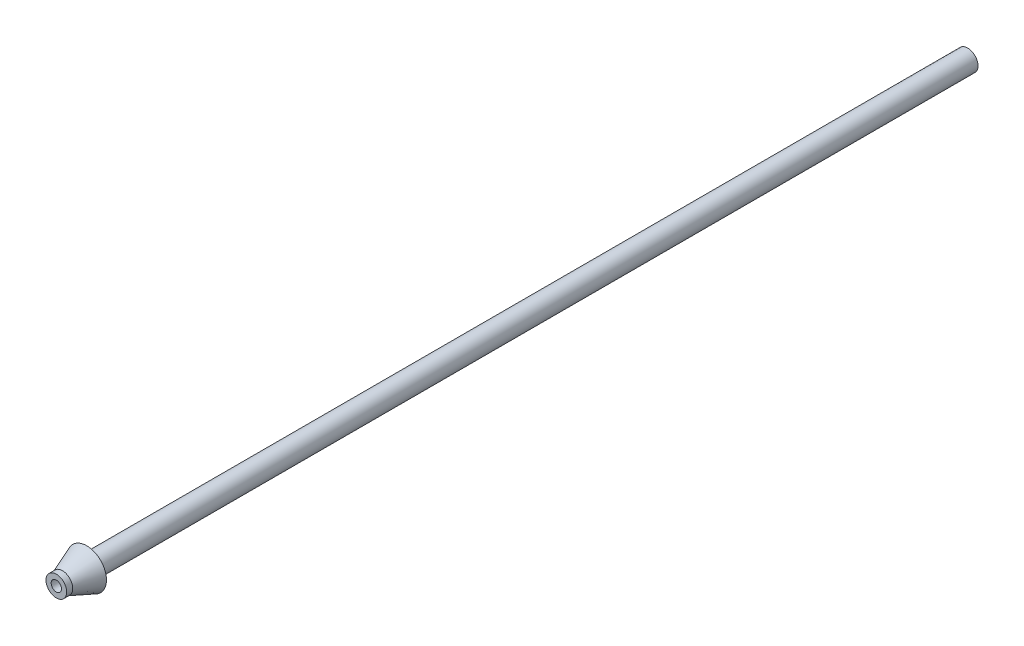
ISO-10303-21;
HEADER;
FILE_DESCRIPTION(('STEP AP214'),'2;1');
FILE_NAME('part.step','',(''),(''),'','','');
FILE_SCHEMA(('AUTOMOTIVE_DESIGN { 1 0 10303 214 1 1 1 1 }'));
ENDSEC;
DATA;
#1=APPLICATION_CONTEXT('core data for automotive mechanical design processes');
#2=APPLICATION_PROTOCOL_DEFINITION('international standard','automotive_design',2000,#1);
#3=PRODUCT_CONTEXT('',#1,'mechanical');
#4=PRODUCT('Part','Part','',(#3));
#5=PRODUCT_RELATED_PRODUCT_CATEGORY('part','',(#4));
#6=PRODUCT_DEFINITION_FORMATION('','',#4);
#7=PRODUCT_DEFINITION_CONTEXT('part definition',#1,'design');
#8=PRODUCT_DEFINITION('design','',#6,#7);
#9=PRODUCT_DEFINITION_SHAPE('','',#8);
#10=(LENGTH_UNIT() NAMED_UNIT(*) SI_UNIT(.MILLI.,.METRE.));
#11=(NAMED_UNIT(*) PLANE_ANGLE_UNIT() SI_UNIT($,.RADIAN.));
#12=(NAMED_UNIT(*) SI_UNIT($,.STERADIAN.) SOLID_ANGLE_UNIT());
#13=UNCERTAINTY_MEASURE_WITH_UNIT(LENGTH_MEASURE(1.E-05),#10,'distance_accuracy_value','');
#14=(GEOMETRIC_REPRESENTATION_CONTEXT(3) GLOBAL_UNCERTAINTY_ASSIGNED_CONTEXT((#13)) GLOBAL_UNIT_ASSIGNED_CONTEXT((#10,
#11,#12)) REPRESENTATION_CONTEXT('',''));
#15=CARTESIAN_POINT('',(0.,0.,0.));
#16=DIRECTION('',(0.,0.,1.));
#17=DIRECTION('',(1.,0.,0.));
#18=AXIS2_PLACEMENT_3D('',#15,#16,#17);
#19=CARTESIAN_POINT('',(0.,0.,150.));
#20=DIRECTION('',(0.,0.,-1.));
#21=DIRECTION('',(-1.,0.,0.));
#22=AXIS2_PLACEMENT_3D('',#19,#20,#21);
#23=CYLINDRICAL_SURFACE('',#22,1.7);
#24=CARTESIAN_POINT('',(0.,0.,150.));
#25=DIRECTION('',(0.,0.,1.));
#26=DIRECTION('',(1.,0.,0.));
#27=AXIS2_PLACEMENT_3D('',#24,#25,#26);
#28=CIRCLE('',#27,1.7);
#29=CARTESIAN_POINT('',(1.7,0.,150.));
#30=VERTEX_POINT('',#29);
#31=EDGE_CURVE('E41',#30,#30,#28,.T.);
#32=ORIENTED_EDGE('',*,*,#31,.F.);
#33=EDGE_LOOP('',(#32));
#34=FACE_BOUND('',#33,.T.);
#35=CARTESIAN_POINT('',(0.,0.,149.));
#36=DIRECTION('',(0.,0.,-1.));
#37=DIRECTION('',(-1.,0.,0.));
#38=AXIS2_PLACEMENT_3D('',#35,#36,#37);
#39=CIRCLE('',#38,1.7);
#40=CARTESIAN_POINT('',(-1.7,0.,149.));
#41=VERTEX_POINT('',#40);
#42=EDGE_CURVE('E10',#41,#41,#39,.T.);
#43=ORIENTED_EDGE('',*,*,#42,.F.);
#44=EDGE_LOOP('',(#43));
#45=FACE_BOUND('',#44,.T.);
#46=ADVANCED_FACE('F31',(#34,#45),#23,.T.);
#47=CARTESIAN_POINT('',(0.,0.,0.));
#48=DIRECTION('',(0.,0.,1.));
#49=DIRECTION('',(1.,0.,0.));
#50=AXIS2_PLACEMENT_3D('',#47,#48,#49);
#51=CIRCLE('',#50,1.7);
#52=CARTESIAN_POINT('',(1.7,0.,0.));
#53=VERTEX_POINT('',#52);
#54=EDGE_CURVE('E45',#53,#53,#51,.T.);
#55=ORIENTED_EDGE('',*,*,#54,.T.);
#56=EDGE_LOOP('',(#55));
#57=FACE_BOUND('',#56,.T.);
#58=CARTESIAN_POINT('',(0.,0.,145.));
#59=DIRECTION('',(0.,0.,1.));
#60=DIRECTION('',(1.,0.,0.));
#61=AXIS2_PLACEMENT_3D('',#58,#59,#60);
#62=CIRCLE('',#61,1.7);
#63=CARTESIAN_POINT('',(1.7,0.,145.));
#64=VERTEX_POINT('',#63);
#65=EDGE_CURVE('E37',#64,#64,#62,.T.);
#66=ORIENTED_EDGE('',*,*,#65,.F.);
#67=EDGE_LOOP('',(#66));
#68=FACE_BOUND('',#67,.T.);
#69=ADVANCED_FACE('F71',(#57,#68),#23,.T.);
#70=CARTESIAN_POINT('',(0.,0.,150.));
#71=DIRECTION('',(0.,0.,1.));
#72=DIRECTION('',(1.,0.,0.));
#73=AXIS2_PLACEMENT_3D('',#70,#71,#72);
#74=PLANE('',#73);
#75=ORIENTED_EDGE('',*,*,#31,.T.);
#76=EDGE_LOOP('',(#75));
#77=FACE_BOUND('',#76,.T.);
#78=CARTESIAN_POINT('',(0.,0.,150.));
#79=DIRECTION('',(0.,0.,1.));
#80=DIRECTION('',(1.,0.,0.));
#81=AXIS2_PLACEMENT_3D('',#78,#79,#80);
#82=CIRCLE('',#81,0.85);
#83=CARTESIAN_POINT('',(0.85,0.,150.));
#84=VERTEX_POINT('',#83);
#85=EDGE_CURVE('E49',#84,#84,#82,.T.);
#86=ORIENTED_EDGE('',*,*,#85,.F.);
#87=EDGE_LOOP('',(#86));
#88=FACE_BOUND('',#87,.T.);
#89=ADVANCED_FACE('F76',(#77,#88),#74,.T.);
#90=CARTESIAN_POINT('',(0.,0.,0.));
#91=DIRECTION('',(0.,0.,1.));
#92=DIRECTION('',(1.,0.,0.));
#93=AXIS2_PLACEMENT_3D('',#90,#91,#92);
#94=PLANE('',#93);
#95=ORIENTED_EDGE('',*,*,#54,.F.);
#96=EDGE_LOOP('',(#95));
#97=FACE_BOUND('',#96,.T.);
#98=CARTESIAN_POINT('',(0.,0.,0.));
#99=DIRECTION('',(0.,0.,1.));
#100=DIRECTION('',(1.,0.,0.));
#101=AXIS2_PLACEMENT_3D('',#98,#99,#100);
#102=CIRCLE('',#101,0.85);
#103=CARTESIAN_POINT('',(0.85,0.,0.));
#104=VERTEX_POINT('',#103);
#105=EDGE_CURVE('E51',#104,#104,#102,.T.);
#106=ORIENTED_EDGE('',*,*,#105,.T.);
#107=EDGE_LOOP('',(#106));
#108=FACE_BOUND('',#107,.T.);
#109=ADVANCED_FACE('F83',(#97,#108),#94,.F.);
#110=CARTESIAN_POINT('',(0.,0.,150.));
#111=DIRECTION('',(0.,0.,-1.));
#112=DIRECTION('',(-1.,0.,0.));
#113=AXIS2_PLACEMENT_3D('',#110,#111,#112);
#114=CYLINDRICAL_SURFACE('',#113,0.85);
#115=ORIENTED_EDGE('',*,*,#85,.T.);
#116=EDGE_LOOP('',(#115));
#117=FACE_BOUND('',#116,.T.);
#118=ORIENTED_EDGE('',*,*,#105,.F.);
#119=EDGE_LOOP('',(#118));
#120=FACE_BOUND('',#119,.T.);
#121=ADVANCED_FACE('F68',(#117,#120),#114,.F.);
#122=CARTESIAN_POINT('',(0.,0.,145.));
#123=DIRECTION('',(0.,0.,-1.));
#124=DIRECTION('',(-1.,0.,0.));
#125=AXIS2_PLACEMENT_3D('',#122,#123,#124);
#126=CONICAL_SURFACE('',#125,3.25,0.369684288795301);
#127=ORIENTED_EDGE('',*,*,#42,.T.);
#128=EDGE_LOOP('',(#127));
#129=FACE_BOUND('',#128,.T.);
#130=CARTESIAN_POINT('',(0.,0.,145.));
#131=DIRECTION('',(0.,0.,1.));
#132=DIRECTION('',(1.,0.,0.));
#133=AXIS2_PLACEMENT_3D('',#130,#131,#132);
#134=CIRCLE('',#133,3.25);
#135=CARTESIAN_POINT('',(3.25,0.,145.));
#136=VERTEX_POINT('',#135);
#137=EDGE_CURVE('E54',#136,#136,#134,.T.);
#138=ORIENTED_EDGE('',*,*,#137,.T.);
#139=EDGE_LOOP('',(#138));
#140=FACE_BOUND('',#139,.T.);
#141=ADVANCED_FACE('F60',(#129,#140),#126,.T.);
#142=CARTESIAN_POINT('',(0.,3.25,145.));
#143=DIRECTION('',(0.,0.,1.));
#144=DIRECTION('',(1.,0.,0.));
#145=AXIS2_PLACEMENT_3D('',#142,#143,#144);
#146=PLANE('',#145);
#147=ORIENTED_EDGE('',*,*,#137,.F.);
#148=EDGE_LOOP('',(#147));
#149=FACE_BOUND('',#148,.T.);
#150=ORIENTED_EDGE('',*,*,#65,.T.);
#151=EDGE_LOOP('',(#150));
#152=FACE_BOUND('',#151,.T.);
#153=ADVANCED_FACE('F62',(#149,#152),#146,.F.);
#154=CLOSED_SHELL('',(#46,#69,#89,#109,#121,#141,#153));
#155=MANIFOLD_SOLID_BREP('B2',#154);
#156=ADVANCED_BREP_SHAPE_REPRESENTATION('',(#18,#155),#14);
#157=SHAPE_DEFINITION_REPRESENTATION(#9,#156);
ENDSEC;
END-ISO-10303-21;
